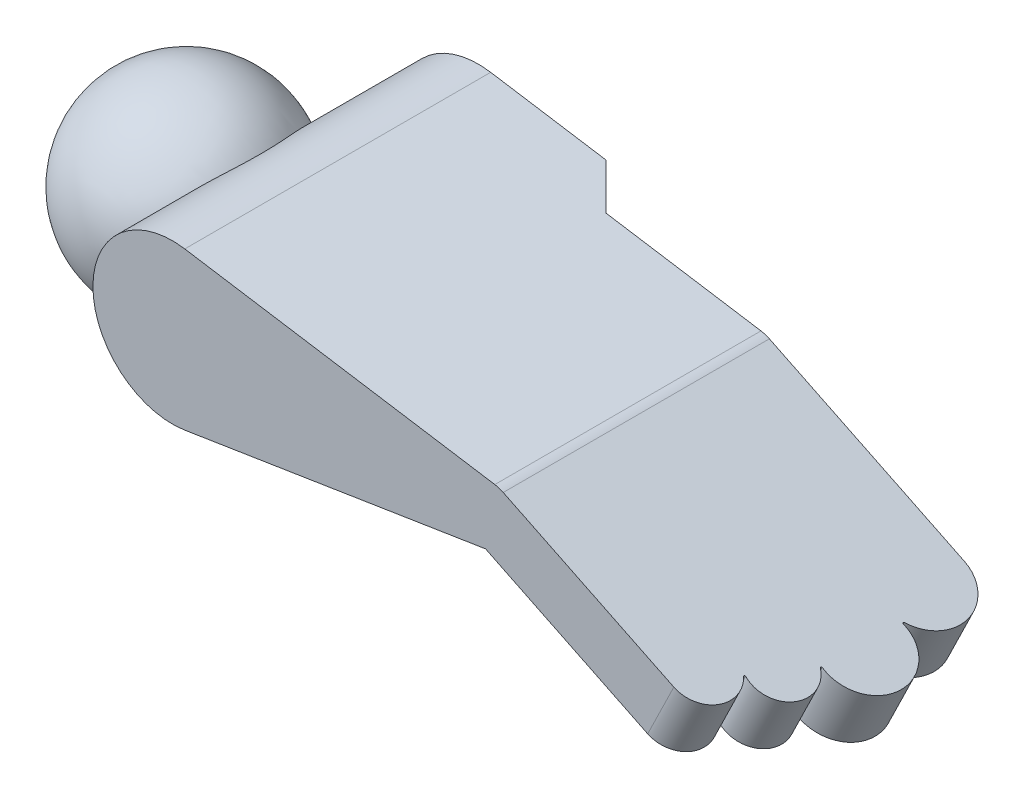
ISO-10303-21;
HEADER;
FILE_DESCRIPTION(('STEP AP214'),'2;1');
FILE_NAME('part.step','',(''),(''),'','','');
FILE_SCHEMA(('AUTOMOTIVE_DESIGN { 1 0 10303 214 1 1 1 1 }'));
ENDSEC;
DATA;
#1=APPLICATION_CONTEXT('core data for automotive mechanical design processes');
#2=APPLICATION_PROTOCOL_DEFINITION('international standard','automotive_design',2000,#1);
#3=PRODUCT_CONTEXT('',#1,'mechanical');
#4=PRODUCT('Part','Part','',(#3));
#5=PRODUCT_RELATED_PRODUCT_CATEGORY('part','',(#4));
#6=PRODUCT_DEFINITION_FORMATION('','',#4);
#7=PRODUCT_DEFINITION_CONTEXT('part definition',#1,'design');
#8=PRODUCT_DEFINITION('design','',#6,#7);
#9=PRODUCT_DEFINITION_SHAPE('','',#8);
#10=(LENGTH_UNIT() NAMED_UNIT(*) SI_UNIT(.MILLI.,.METRE.));
#11=(NAMED_UNIT(*) PLANE_ANGLE_UNIT() SI_UNIT($,.RADIAN.));
#12=(NAMED_UNIT(*) SI_UNIT($,.STERADIAN.) SOLID_ANGLE_UNIT());
#13=UNCERTAINTY_MEASURE_WITH_UNIT(LENGTH_MEASURE(1.E-05),#10,'distance_accuracy_value','');
#14=(GEOMETRIC_REPRESENTATION_CONTEXT(3) GLOBAL_UNCERTAINTY_ASSIGNED_CONTEXT((#13)) GLOBAL_UNIT_ASSIGNED_CONTEXT((#10,
#11,#12)) REPRESENTATION_CONTEXT('',''));
#15=CARTESIAN_POINT('',(0.,0.,0.));
#16=DIRECTION('',(0.,0.,1.));
#17=DIRECTION('',(1.,0.,0.));
#18=AXIS2_PLACEMENT_3D('',#15,#16,#17);
#19=CARTESIAN_POINT('',(-1.11022302462516E-13,0.,42.545));
#20=DIRECTION('',(0.,0.,-1.));
#21=DIRECTION('',(-1.,0.,0.));
#22=AXIS2_PLACEMENT_3D('',#19,#20,#21);
#23=CYLINDRICAL_SURFACE('',#22,25.4);
#24=CARTESIAN_POINT('',(-14.2875000000001,21.0006510315752,0.));
#25=CARTESIAN_POINT('',(-14.2874986942665,21.0006504840851,0.445221900465597));
#26=CARTESIAN_POINT('',(-14.2953081922359,20.9953449296755,0.890426361089322));
#27=CARTESIAN_POINT('',(-14.3264868198177,20.9740826371853,1.78007168919305));
#28=CARTESIAN_POINT('',(-14.3498569674293,20.9581252022439,2.22451250480701));
#29=CARTESIAN_POINT('',(-14.4120006937447,20.9154409688301,3.11188211675979));
#30=CARTESIAN_POINT('',(-14.4507770141651,20.8887122534647,3.5548106298074));
#31=CARTESIAN_POINT('',(-14.5434469305168,20.8242950444131,4.43829447397916));
#32=CARTESIAN_POINT('',(-14.5973419405579,20.7866055255082,4.87884957917874));
#33=CARTESIAN_POINT('',(-14.7813505313174,20.6565920938604,6.19704823314705));
#34=CARTESIAN_POINT('',(-14.933707064299,20.5473762862208,7.07009349322586));
#35=CARTESIAN_POINT('',(-15.2933299297853,20.2811215383024,8.79718220074844));
#36=CARTESIAN_POINT('',(-15.5005922793714,20.1240860667829,9.65122702163243));
#37=CARTESIAN_POINT('',(-15.9644327536828,19.7581430548751,11.3354310139956));
#38=CARTESIAN_POINT('',(-16.2210585055284,19.5491853612722,12.1655662202228));
#39=CARTESIAN_POINT('',(-16.7762879292823,19.0748373220827,13.7952811622892));
#40=CARTESIAN_POINT('',(-17.074896817441,18.8094399619717,14.5948570855255));
#41=CARTESIAN_POINT('',(-17.7050993456687,18.2174673783565,16.1564260717051));
#42=CARTESIAN_POINT('',(-18.0366554205533,17.8909614615965,16.9184604878274));
#43=CARTESIAN_POINT('',(-18.72301395747,17.1713645796119,18.3992916126226));
#44=CARTESIAN_POINT('',(-19.077807491936,16.7782990948599,19.1181047252024));
#45=CARTESIAN_POINT('',(-19.6980741774511,16.0408372382135,20.3109683821504));
#46=CARTESIAN_POINT('',(-19.9607294175346,15.7136483536111,20.7971804645095));
#47=CARTESIAN_POINT('',(-20.4873489903725,15.020582613139,21.740533970935));
#48=CARTESIAN_POINT('',(-20.751313205354,14.65470917974,22.197677960971));
#49=CARTESIAN_POINT('',(-21.274961865544,13.8835494219702,23.0789641510367));
#50=CARTESIAN_POINT('',(-21.5346511969972,13.4783123676139,23.5031464403229));
#51=CARTESIAN_POINT('',(-22.0443412853832,12.627461213939,24.3153484578363));
#52=CARTESIAN_POINT('',(-22.2943438885055,12.1818548631691,24.7033750969559));
#53=CARTESIAN_POINT('',(-22.7308063467688,11.3423138017661,25.3666569582657));
#54=CARTESIAN_POINT('',(-22.9200834161576,10.9554874876247,25.6490711097611));
#55=CARTESIAN_POINT('',(-23.2850711723189,10.1566817400668,26.1856234423785));
#56=CARTESIAN_POINT('',(-23.4607847356159,9.74470767331466,26.4397676240166));
#57=CARTESIAN_POINT('',(-23.7952610731409,8.89680874924633,26.9174378992023));
#58=CARTESIAN_POINT('',(-23.9540252529345,8.46088588248605,27.1409665320487));
#59=CARTESIAN_POINT('',(-24.2512534757126,7.56693688587108,27.5550523199941));
#60=CARTESIAN_POINT('',(-24.389717192859,7.10891040139304,27.7456089458758));
#61=CARTESIAN_POINT('',(-24.6441297571778,6.16971403368266,28.0928032591503));
#62=CARTESIAN_POINT('',(-24.7598936666472,5.6883909170392,28.2491634433944));
#63=CARTESIAN_POINT('',(-24.9646033773291,4.70941624230395,28.5239230460117));
#64=CARTESIAN_POINT('',(-25.0535487892989,4.21176444733458,28.6423219134173));
#65=CARTESIAN_POINT('',(-25.2021646538441,3.20465425990388,28.8393336708689));
#66=CARTESIAN_POINT('',(-25.2618533468752,2.6952034317352,28.9179713514764));
#67=CARTESIAN_POINT('',(-25.3503347241816,1.66901685292011,29.0343147307974));
#68=CARTESIAN_POINT('',(-25.3791317155348,1.15228212801263,29.0720261356688));
#69=CARTESIAN_POINT('',(-25.4033365174728,0.183902258199813,29.1037264095119));
#70=CARTESIAN_POINT('',(-25.4025903098687,-0.267492897680797,29.1027514849805));
#71=CARTESIAN_POINT('',(-25.3771121944252,-1.16840876612937,29.0693781103997));
#72=CARTESIAN_POINT('',(-25.3523827477916,-1.61792966628318,29.0369828847616));
#73=CARTESIAN_POINT('',(-25.279490574644,-2.5116470499489,28.9411810594653));
#74=CARTESIAN_POINT('',(-25.2313313649835,-2.95584432229802,28.877779113969));
#75=CARTESIAN_POINT('',(-25.1126199815715,-3.835809586465,28.7207294192038));
#76=CARTESIAN_POINT('',(-25.042067395072,-4.27157742275694,28.6270811124424));
#77=CARTESIAN_POINT('',(-24.8822465753656,-5.12006857663347,28.4135663160798));
#78=CARTESIAN_POINT('',(-24.7935407591993,-5.5330962716872,28.2944838477271));
#79=CARTESIAN_POINT('',(-24.5979903249191,-6.34615695257182,28.0299277091399));
#80=CARTESIAN_POINT('',(-24.4911463087952,-6.74619036914597,27.8844549147648));
#81=CARTESIAN_POINT('',(-24.2611922024166,-7.53139660098542,27.5684655593425));
#82=CARTESIAN_POINT('',(-24.1380815889216,-7.9165689377058,27.3979481926779));
#83=CARTESIAN_POINT('',(-23.8776053229467,-8.67058905862422,27.0332991326326));
#84=CARTESIAN_POINT('',(-23.7402378123342,-9.03943470597031,26.8391643605748));
#85=CARTESIAN_POINT('',(-23.4382445568038,-9.79756248541905,26.4071611140558));
#86=CARTESIAN_POINT('',(-23.2722715653822,-10.1849101485111,26.1668402326586));
#87=CARTESIAN_POINT('',(-22.9283245879777,-10.9372326187328,25.6611527226464));
#88=CARTESIAN_POINT('',(-22.7503501265942,-11.3022065385025,25.3957851017169));
#89=CARTESIAN_POINT('',(-22.3850891575176,-12.009424049734,24.8417600918975));
#90=CARTESIAN_POINT('',(-22.1977975852448,-12.351655037252,24.5530899820029));
#91=CARTESIAN_POINT('',(-21.8166665848664,-13.013024023214,23.9543768612102));
#92=CARTESIAN_POINT('',(-21.6228259741794,-13.3321578178764,23.6443299796046));
#93=CARTESIAN_POINT('',(-21.1336062810806,-14.1006775780672,22.8451903507569));
#94=CARTESIAN_POINT('',(-20.8357310304868,-14.5357893412475,22.3438210130412));
#95=CARTESIAN_POINT('',(-20.2390038816648,-15.3557839209573,21.3020218669451));
#96=CARTESIAN_POINT('',(-19.9401516449805,-15.7406468866986,20.7615767518924));
#97=CARTESIAN_POINT('',(-19.3483285713351,-16.4626964595998,19.6455313531435));
#98=CARTESIAN_POINT('',(-19.0553662922109,-16.7998174686625,19.069884225942));
#99=CARTESIAN_POINT('',(-18.4822534895632,-17.4283449288991,17.888244173111));
#100=CARTESIAN_POINT('',(-18.2021018325467,-17.7197554301379,17.2822539422397));
#101=CARTESIAN_POINT('',(-17.6555385601781,-18.2645421536684,16.0325252976359));
#102=CARTESIAN_POINT('',(-17.3894597033053,-18.5171502143908,15.388307362588));
#103=CARTESIAN_POINT('',(-16.8819412450539,-18.9809974338255,14.0757640556329));
#104=CARTESIAN_POINT('',(-16.6405018685819,-19.1922362149396,13.407438463749));
#105=CARTESIAN_POINT('',(-16.187086473272,-19.5761715888971,12.0502610269937));
#106=CARTESIAN_POINT('',(-15.9751029506536,-19.748878004547,11.3614144642725));
#107=CARTESIAN_POINT('',(-15.5846354049784,-20.0584443736292,9.9663637939211));
#108=CARTESIAN_POINT('',(-15.4061540631933,-20.1953014582875,9.26015830211918));
#109=CARTESIAN_POINT('',(-15.057140977541,-20.457239134323,7.70429763836023));
#110=CARTESIAN_POINT('',(-14.893927079856,-20.575677783891,6.85186323566165));
#111=CARTESIAN_POINT('',(-14.623601226045,-20.7686751885555,5.13318218970042));
#112=CARTESIAN_POINT('',(-14.516494915344,-20.8432295282001,4.26693416557322));
#113=CARTESIAN_POINT('',(-14.3613252214602,-20.9504482731531,2.52642942223252));
#114=CARTESIAN_POINT('',(-14.3132716710879,-20.9831057022924,1.65217139369096));
#115=CARTESIAN_POINT('',(-14.2775752024917,-21.0074107874628,-0.0981238573051221));
#116=CARTESIAN_POINT('',(-14.2899310179491,-20.9990593031344,-0.974161042079673));
#117=CARTESIAN_POINT('',(-14.3753479695873,-20.9406805821823,-2.73510967254932));
#118=CARTESIAN_POINT('',(-14.4493194834229,-20.8900283183938,-3.61995637844773));
#119=CARTESIAN_POINT('',(-14.6570509388758,-20.7448032633027,-5.37897980113163));
#120=CARTESIAN_POINT('',(-14.7908128513621,-20.6502290241973,-6.25315616521507));
#121=CARTESIAN_POINT('',(-15.1144931659491,-20.4145085488666,-7.98547571101311));
#122=CARTESIAN_POINT('',(-15.3044607078546,-20.2733215471805,-8.84360416133193));
#123=CARTESIAN_POINT('',(-15.7351836903612,-19.9408609717466,-10.5371029047903));
#124=CARTESIAN_POINT('',(-15.9759382526865,-19.749588264133,-11.372473591205));
#125=CARTESIAN_POINT('',(-16.502983252549,-19.3113853670171,-13.0192803252172));
#126=CARTESIAN_POINT('',(-16.7895217254826,-19.0641487636749,-13.8305556871584));
#127=CARTESIAN_POINT('',(-17.3989974589035,-18.5095808350739,-15.4183814530545));
#128=CARTESIAN_POINT('',(-17.7219398091186,-18.2022411022038,-16.1949269800825));
#129=CARTESIAN_POINT('',(-18.3940944779414,-17.5227091131552,-17.7057164687854));
#130=CARTESIAN_POINT('',(-18.7432676229845,-17.1506125133527,-18.4400207281911));
#131=CARTESIAN_POINT('',(-19.457196742374,-16.3361687985509,-19.8603809612778));
#132=CARTESIAN_POINT('',(-19.8219449912997,-15.8938562222404,-20.546460418213));
#133=CARTESIAN_POINT('',(-20.436376464989,-15.0891288542457,-21.650491023163));
#134=CARTESIAN_POINT('',(-20.6852896043994,-14.7468519300986,-22.0836404499622));
#135=CARTESIAN_POINT('',(-21.1800880698568,-14.0269234948975,-22.9213987966382));
#136=CARTESIAN_POINT('',(-21.4259737436976,-13.6492760909071,-23.326011020588));
#137=CARTESIAN_POINT('',(-21.9096759813927,-12.8584862291663,-24.1031257854199));
#138=CARTESIAN_POINT('',(-22.1475016927433,-12.4453860275079,-24.4756655205535));
#139=CARTESIAN_POINT('',(-22.6102745449211,-11.5833772847154,-25.1857389967294));
#140=CARTESIAN_POINT('',(-22.8352237511423,-11.1344745141227,-25.5232783589269));
#141=CARTESIAN_POINT('',(-23.2283719835899,-10.2849914243429,-26.1029280496934));
#142=CARTESIAN_POINT('',(-23.3995385318585,-9.89006479986963,-26.3513230174568));
#143=CARTESIAN_POINT('',(-23.7264812663222,-9.07775684684525,-26.8198667123015));
#144=CARTESIAN_POINT('',(-23.8822605045342,-8.66037999668382,-27.0400210434078));
#145=CARTESIAN_POINT('',(-24.1753982658379,-7.80477817202379,-27.449952314982));
#146=CARTESIAN_POINT('',(-24.3127591392672,-7.36655586726711,-27.6397331319642));
#147=CARTESIAN_POINT('',(-24.5661721357114,-6.47143811366118,-27.9868713512135));
#148=CARTESIAN_POINT('',(-24.6822239483945,-6.01454239298258,-28.1442282812836));
#149=CARTESIAN_POINT('',(-24.891045116151,-5.08189863963258,-28.4255181092953));
#150=CARTESIAN_POINT('',(-24.9836555781958,-4.6060459944122,-28.5492233058053));
#151=CARTESIAN_POINT('',(-25.1422934569433,-3.64193759713006,-28.760153178234));
#152=CARTESIAN_POINT('',(-25.208320586449,-3.15368171112862,-28.8473774600261));
#153=CARTESIAN_POINT('',(-25.3120469887455,-2.16914273854083,-28.9840501416499));
#154=CARTESIAN_POINT('',(-25.3497587696533,-1.67286329539576,-29.0335152215191));
#155=CARTESIAN_POINT('',(-25.3958801163721,-0.676633260395486,-29.0939771236016));
#156=CARTESIAN_POINT('',(-25.4042927659409,-0.176683060441385,-29.1049779942053));
#157=CARTESIAN_POINT('',(-25.3923157033826,0.766304832102019,-29.0892927409928));
#158=CARTESIAN_POINT('',(-25.3750400497521,1.20945816685978,-29.0666813510512));
#159=CARTESIAN_POINT('',(-25.3175888579372,2.09165898268628,-28.9912780131989));
#160=CARTESIAN_POINT('',(-25.2774153583744,2.53070682573524,-28.9384887520578));
#161=CARTESIAN_POINT('',(-25.175019659029,3.40156093716508,-28.8033599943676));
#162=CARTESIAN_POINT('',(-25.1127994210798,3.83336784630239,-28.7210231271098));
#163=CARTESIAN_POINT('',(-24.9675772230404,4.68695346128786,-28.527727082686));
#164=CARTESIAN_POINT('',(-24.884574626392,5.10873185953195,-28.4167670287958));
#165=CARTESIAN_POINT('',(-24.6995938082608,5.93890324025257,-28.1676590049885));
#166=CARTESIAN_POINT('',(-24.5976546363742,6.34732177001901,-28.0295669514588));
#167=CARTESIAN_POINT('',(-24.3765577215041,7.14958616940364,-27.7274053779981));
#168=CARTESIAN_POINT('',(-24.2574002237255,7.54343224644696,-27.5633362280021));
#169=CARTESIAN_POINT('',(-24.0038934966984,8.31492606818444,-27.2106645660801));
#170=CARTESIAN_POINT('',(-23.8695429343697,8.69257238745235,-27.0220599011237));
#171=CARTESIAN_POINT('',(-23.5877809959133,9.4304076486978,-26.6218229466976));
#172=CARTESIAN_POINT('',(-23.4403678470098,9.79059421084868,-26.410187530741));
#173=CARTESIAN_POINT('',(-23.1157715918168,10.5359429477581,-25.9379394700155));
#174=CARTESIAN_POINT('',(-22.9371602672121,10.9186960590394,-25.6745060484112));
#175=CARTESIAN_POINT('',(-22.5692452788229,11.6602112282317,-25.1226021883565));
#176=CARTESIAN_POINT('',(-22.3799410682892,12.0189720573157,-24.8341304692409));
#177=CARTESIAN_POINT('',(-21.9934803227064,12.7123739254043,-24.2339795416666));
#178=CARTESIAN_POINT('',(-21.796319585391,13.0470017799465,-23.9222878337507));
#179=CARTESIAN_POINT('',(-21.3970326149972,13.6920020480466,-23.27767906627));
#180=CARTESIAN_POINT('',(-21.1949054876361,14.0023700505086,-22.944758166555));
#181=CARTESIAN_POINT('',(-20.6843714396607,14.751764240628,-22.0841471339592));
#182=CARTESIAN_POINT('',(-20.3744622422452,15.1754402942078,-21.5439018143078));
#183=CARTESIAN_POINT('',(-19.7577641712185,15.9700955542904,-20.4241968504163));
#184=CARTESIAN_POINT('',(-19.4509766028517,16.3410534957322,-19.8447215202125));
#185=CARTESIAN_POINT('',(-18.8476413750872,17.0334256985636,-18.6504649392776));
#186=CARTESIAN_POINT('',(-18.551110662881,17.3547607446053,-18.0356293450129));
#187=CARTESIAN_POINT('',(-17.9755771371757,17.9502116863526,-16.7758230917445));
#188=CARTESIAN_POINT('',(-17.6965724887382,18.2243325305282,-16.1308555998512));
#189=CARTESIAN_POINT('',(-17.1574124395316,18.7329370633162,-14.8032264266137));
#190=CARTESIAN_POINT('',(-16.8976653476613,18.9666552048907,-14.1201063637877));
#191=CARTESIAN_POINT('',(-16.4079806079214,19.3918373031754,-12.730413996964));
#192=CARTESIAN_POINT('',(-16.1780448431024,19.5832985912416,-12.0238402150351));
#193=CARTESIAN_POINT('',(-15.7530639248419,19.9267544702823,-10.5918838926758));
#194=CARTESIAN_POINT('',(-15.5579771222208,20.0787962723092,-9.86652500684206));
#195=CARTESIAN_POINT('',(-15.2064216883631,20.3463415235515,-8.39995738188528));
#196=CARTESIAN_POINT('',(-15.0499477829225,20.4618499635315,-7.65875082246988));
#197=CARTESIAN_POINT('',(-14.8116059079042,20.6347355531499,-6.34493500809818));
#198=CARTESIAN_POINT('',(-14.7208466792511,20.6994150797693,-5.77486956138397));
#199=CARTESIAN_POINT('',(-14.5644656215408,20.809746359997,-4.62953309722101));
#200=CARTESIAN_POINT('',(-14.4988402141455,20.8554008223124,-4.05426283273617));
#201=CARTESIAN_POINT('',(-14.3935012062785,20.9282396035887,-2.90007628078942));
#202=CARTESIAN_POINT('',(-14.3537931079563,20.955420000624,-2.32115924545218));
#203=CARTESIAN_POINT('',(-14.3007922663058,20.9916268208374,-1.1614850149657));
#204=CARTESIAN_POINT('',(-14.2875017031411,21.000651745697,-0.580727671902138));
#205=CARTESIAN_POINT('',(-14.2875000000001,21.0006510315752,0.));
#206=B_SPLINE_CURVE_WITH_KNOTS('',3,(#24,#25,#26,#27,#28,#29,#30,#31,#32,#33,#34,#35,#36,#37,
#38,#39,#40,#41,#42,#43,#44,#45,#46,#47,#48,#49,#50,#51,#52,#53,#54,#55,#56,#57,#58,#59,#60,#61,
#62,#63,#64,#65,#66,#67,#68,#69,#70,#71,#72,#73,#74,#75,#76,#77,#78,#79,#80,#81,#82,#83,#84,#85,
#86,#87,#88,#89,#90,#91,#92,#93,#94,#95,#96,#97,#98,#99,#100,#101,#102,#103,#104,#105,#106,#107,
#108,#109,#110,#111,#112,#113,#114,#115,#116,#117,#118,#119,#120,#121,#122,#123,#124,#125,#126,
#127,#128,#129,#130,#131,#132,#133,#134,#135,#136,#137,#138,#139,#140,#141,#142,#143,#144,#145,
#146,#147,#148,#149,#150,#151,#152,#153,#154,#155,#156,#157,#158,#159,#160,#161,#162,#163,#164,
#165,#166,#167,#168,#169,#170,#171,#172,#173,#174,#175,#176,#177,#178,#179,#180,#181,#182,#183,
#184,#185,#186,#187,#188,#189,#190,#191,#192,#193,#194,#195,#196,#197,#198,#199,#200,#201,#202,
#203,#204,#205),.UNSPECIFIED.,.T.,.F.,(4,2,2,2,2,2,2,2,2,2,2,2,2,2,2,2,2,2,2,2,2,2,2,2,2,2,2,2,
2,2,2,2,2,2,2,2,2,2,2,2,2,2,2,2,2,2,2,2,2,2,2,2,2,2,2,2,2,2,2,2,2,2,2,2,2,2,2,2,2,2,2,2,2,2,2,2,
2,2,2,2,2,2,2,2,2,2,2,2,2,2,4),(0.,1.33553453870049,2.67115645849026,4.00701617506112,
5.34300088146883,8.01836659782021,10.6935382937792,13.3713041313765,16.0494029660292,
18.7244826207466,21.3985405015369,23.3235736274041,25.248436585455,27.1709205686333,
29.0930363257601,30.6365856970336,32.1798068105105,33.7228998493409,35.2660176532956,
36.8212278977692,38.3764607134181,39.9307226630667,41.4847678814431,42.8372635889265,
44.1896205154007,45.5417745130463,46.8939534346378,48.209283924538,49.5245707683715,
50.8398999307591,52.1554007386584,53.6093464692773,55.0633498272503,56.5181523753357,
57.9732190409083,60.1528571378663,62.3333537121839,64.5168178386656,66.7000883953737,
68.9221679816625,71.1442678490391,73.3658006019902,75.5875110745736,78.2123219991518,
80.837396975877,83.4629089917733,86.088365971166,88.7533169834432,91.4183558468972,
94.085731636974,96.753061303067,99.4353644146858,102.118043012817,104.796791984184,
107.474227359658,109.28947345652,111.104509035735,112.917410550587,114.730020456094,
116.219465223252,117.708613968729,119.19757250513,120.686552724063,122.185370628423,
123.68420472505,125.182376331515,126.680390249409,128.010975946393,129.341443198293,
130.671792088014,132.002181730965,133.329857799361,134.657514962266,135.98528870788,
137.313242927768,138.805197338486,140.297228105088,141.790067926469,143.283178558039,
145.539671353279,147.797071788768,150.058039374249,152.318769845749,154.61850887813,
156.918393104233,159.215509997661,161.512312949924,163.254059611024,164.995558204898,
166.73742639238,168.479438325291),.UNSPECIFIED.);
#207=CARTESIAN_POINT('',(-14.2875000000001,21.0006510315752,0.));
#208=VERTEX_POINT('',#207);
#209=EDGE_CURVE('E20',#208,#208,#206,.T.);
#210=ORIENTED_EDGE('',*,*,#209,.T.);
#211=EDGE_LOOP('',(#210));
#212=FACE_BOUND('',#211,.T.);
#213=CARTESIAN_POINT('',(-1.11022302462516E-13,0.,-29.845));
#214=DIRECTION('',(0.,0.,-1.));
#215=DIRECTION('',(-1.,0.,0.));
#216=AXIS2_PLACEMENT_3D('',#213,#214,#215);
#217=CIRCLE('',#216,25.4);
#218=CARTESIAN_POINT('',(3.96874999999997,-25.0880254989805,-29.845));
#219=VERTEX_POINT('',#218);
#220=CARTESIAN_POINT('',(-21.9970452561249,-12.6999999999998,-29.845));
#221=VERTEX_POINT('',#220);
#222=EDGE_CURVE('E311',#219,#221,#217,.T.);
#223=ORIENTED_EDGE('',*,*,#222,.F.);
#224=DIRECTION('',(0.,0.,-1.));
#225=VECTOR('',#224,1.);
#226=CARTESIAN_POINT('',(3.96874999999985,-25.0880254989806,42.545));
#227=LINE('',#226,#225);
#228=CARTESIAN_POINT('',(3.96874999999985,-25.0880254989806,42.545));
#229=VERTEX_POINT('',#228);
#230=EDGE_CURVE('E283',#229,#219,#227,.T.);
#231=ORIENTED_EDGE('',*,*,#230,.F.);
#232=CARTESIAN_POINT('',(-1.11022302462516E-13,0.,42.545));
#233=DIRECTION('',(0.,0.,1.));
#234=DIRECTION('',(1.,0.,0.));
#235=AXIS2_PLACEMENT_3D('',#232,#233,#234);
#236=CIRCLE('',#235,25.4);
#237=CARTESIAN_POINT('',(3.96874999999997,25.0880254989806,42.545));
#238=VERTEX_POINT('',#237);
#239=EDGE_CURVE('E281',#238,#229,#236,.T.);
#240=ORIENTED_EDGE('',*,*,#239,.F.);
#241=DIRECTION('',(0.,0.,-1.));
#242=VECTOR('',#241,1.);
#243=CARTESIAN_POINT('',(3.96874999999997,25.0880254989806,42.545));
#244=LINE('',#243,#242);
#245=CARTESIAN_POINT('',(3.96874999999997,25.0880254989806,-55.245));
#246=VERTEX_POINT('',#245);
#247=EDGE_CURVE('E175',#238,#246,#244,.T.);
#248=ORIENTED_EDGE('',*,*,#247,.T.);
#249=CARTESIAN_POINT('',(-1.11022302462516E-13,0.,-55.245));
#250=DIRECTION('',(0.,0.,-1.));
#251=DIRECTION('',(-1.,0.,0.));
#252=AXIS2_PLACEMENT_3D('',#249,#250,#251);
#253=CIRCLE('',#252,25.4);
#254=CARTESIAN_POINT('',(-21.9970452561249,-12.6999999999998,-55.245));
#255=VERTEX_POINT('',#254);
#256=EDGE_CURVE('E172',#255,#246,#253,.T.);
#257=ORIENTED_EDGE('',*,*,#256,.F.);
#258=DIRECTION('',(0.,0.,-1.));
#259=VECTOR('',#258,1.);
#260=CARTESIAN_POINT('',(-21.9970452561249,-12.6999999999998,-29.845));
#261=LINE('',#260,#259);
#262=EDGE_CURVE('E159',#221,#255,#261,.T.);
#263=ORIENTED_EDGE('',*,*,#262,.F.);
#264=EDGE_LOOP('',(#223,#231,#240,#248,#257,#263));
#265=FACE_BOUND('',#264,.T.);
#266=ADVANCED_FACE('F16',(#212,#265),#23,.T.);
#267=CARTESIAN_POINT('',(176.861881251004,-47.3235725570233,42.5450000000001));
#268=DIRECTION('',(0.43853899941014,0.898712159702067,0.));
#269=DIRECTION('',(-0.898712159702067,0.43853899941014,0.));
#270=AXIS2_PLACEMENT_3D('',#267,#268,#269);
#271=PLANE('',#270);
#272=CARTESIAN_POINT('',(159.741414608679,-38.9694046182602,-29.845));
#273=DIRECTION('',(0.43853899941014,0.898712159702067,0.));
#274=DIRECTION('',(-0.898712159702067,0.43853899941014,0.));
#275=AXIS2_PLACEMENT_3D('',#272,#273,#274);
#276=CIRCLE('',#275,12.7);
#277=CARTESIAN_POINT('',(164.716588696425,-41.3971094654436,-18.4150440958163));
#278=VERTEX_POINT('',#277);
#279=CARTESIAN_POINT('',(159.741414608679,-38.9694046182602,-42.5449999999999));
#280=VERTEX_POINT('',#279);
#281=EDGE_CURVE('E243',#278,#280,#276,.T.);
#282=ORIENTED_EDGE('',*,*,#281,.F.);
#283=CARTESIAN_POINT('',(164.81609217818,-41.4456635623873,-18.1864449777326));
#284=DIRECTION('',(0.43853899941014,0.898712159702067,0.));
#285=DIRECTION('',(-0.898712159702067,0.43853899941014,0.));
#286=AXIS2_PLACEMENT_3D('',#283,#284,#285);
#287=CIRCLE('',#286,0.254000000000002);
#288=CARTESIAN_POINT('',(164.828487171211,-41.451711870272,-17.9328196987885));
#289=VERTEX_POINT('',#288);
#290=EDGE_CURVE('E265',#289,#278,#287,.F.);
#291=ORIENTED_EDGE('',*,*,#290,.F.);
#292=CARTESIAN_POINT('',(165.448236822787,-41.7541272645145,-5.25155575158287));
#293=DIRECTION('',(0.43853899941014,0.898712159702067,0.));
#294=DIRECTION('',(-0.898712159702067,0.43853899941014,0.));
#295=AXIS2_PLACEMENT_3D('',#292,#293,#294);
#296=CIRCLE('',#295,12.7);
#297=CARTESIAN_POINT('',(164.238904245477,-41.1640167461661,7.37695501943009));
#298=VERTEX_POINT('',#297);
#299=EDGE_CURVE('E263',#298,#289,#296,.T.);
#300=ORIENTED_EDGE('',*,*,#299,.F.);
#301=CARTESIAN_POINT('',(164.21471759393,-41.1522145357992,7.62952523485033));
#302=DIRECTION('',(0.43853899941014,0.898712159702067,0.));
#303=DIRECTION('',(-0.898712159702067,0.43853899941014,0.));
#304=AXIS2_PLACEMENT_3D('',#301,#302,#303);
#305=CIRCLE('',#304,0.253999999999994);
#306=CARTESIAN_POINT('',(164.098527906002,-41.0955181743046,7.84816072833744));
#307=VERTEX_POINT('',#306);
#308=EDGE_CURVE('E261',#307,#298,#305,.F.);
#309=ORIENTED_EDGE('',*,*,#308,.F.);
#310=CARTESIAN_POINT('',(159.741414608679,-38.9694046182602,16.0469917341026));
#311=DIRECTION('',(0.43853899941014,0.898712159702067,0.));
#312=DIRECTION('',(-0.898712159702067,0.43853899941014,0.));
#313=AXIS2_PLACEMENT_3D('',#310,#311,#312);
#314=CIRCLE('',#313,9.525);
#315=CARTESIAN_POINT('',(157.682532504989,-37.9647446858131,25.2923845274479));
#316=VERTEX_POINT('',#315);
#317=EDGE_CURVE('E259',#316,#307,#314,.T.);
#318=ORIENTED_EDGE('',*,*,#317,.F.);
#319=CARTESIAN_POINT('',(157.627628982224,-37.9379537542812,25.5389283352705));
#320=DIRECTION('',(0.43853899941014,0.898712159702067,0.));
#321=DIRECTION('',(-0.898712159702067,0.43853899941014,0.));
#322=AXIS2_PLACEMENT_3D('',#319,#320,#321);
#323=CIRCLE('',#322,0.254000000000007);
#324=CARTESIAN_POINT('',(157.480618119654,-37.8662177753273,25.7332418850037));
#325=VERTEX_POINT('',#324);
#326=EDGE_CURVE('E257',#325,#316,#323,.F.);
#327=ORIENTED_EDGE('',*,*,#326,.F.);
#328=CARTESIAN_POINT('',(151.967710773275,-35.1761185645596,33.0200000000001));
#329=DIRECTION('',(0.43853899941014,0.898712159702067,0.));
#330=DIRECTION('',(-0.898712159702067,0.43853899941014,0.));
#331=AXIS2_PLACEMENT_3D('',#328,#329,#330);
#332=CIRCLE('',#331,9.525);
#333=CARTESIAN_POINT('',(151.967710773275,-35.1761185645596,42.545));
#334=VERTEX_POINT('',#333);
#335=EDGE_CURVE('E255',#334,#325,#332,.T.);
#336=ORIENTED_EDGE('',*,*,#335,.F.);
#337=DIRECTION('',(0.898712159702067,-0.43853899941014,0.));
#338=VECTOR('',#337,1.);
#339=CARTESIAN_POINT('',(176.861881251004,-47.3235725570233,42.5450000000001));
#340=LINE('',#339,#338);
#341=CARTESIAN_POINT('',(100.121947229302,-9.87726283775399,42.545));
#342=VERTEX_POINT('',#341);
#343=EDGE_CURVE('E271',#342,#334,#340,.T.);
#344=ORIENTED_EDGE('',*,*,#343,.F.);
#345=DIRECTION('',(0.,0.,-1.));
#346=VECTOR('',#345,1.);
#347=CARTESIAN_POINT('',(100.121947229302,-9.87726283775399,42.545));
#348=LINE('',#347,#346);
#349=CARTESIAN_POINT('',(100.121947229302,-9.87726283775399,-42.545));
#350=VERTEX_POINT('',#349);
#351=EDGE_CURVE('E303',#342,#350,#348,.T.);
#352=ORIENTED_EDGE('',*,*,#351,.T.);
#353=DIRECTION('',(0.898712159702067,-0.43853899941014,0.));
#354=VECTOR('',#353,1.);
#355=CARTESIAN_POINT('',(176.861881251003,-47.3235725570233,-42.5449999999999));
#356=LINE('',#355,#354);
#357=EDGE_CURVE('E285',#350,#280,#356,.T.);
#358=ORIENTED_EDGE('',*,*,#357,.T.);
#359=EDGE_LOOP('',(#282,#291,#300,#309,#318,#327,#336,#344,#352,#358));
#360=FACE_BOUND('',#359,.T.);
#361=ADVANCED_FACE('F341',(#360),#271,.F.);
#362=CARTESIAN_POINT('',(105.777083969382,8.56023332116211,42.545));
#363=DIRECTION('',(-0.43853899941014,-0.898712159702067,0.));
#364=DIRECTION('',(0.898712159702067,-0.43853899941014,0.));
#365=AXIS2_PLACEMENT_3D('',#362,#363,#364);
#366=PLANE('',#365);
#367=CARTESIAN_POINT('',(168.095582547442,-21.8489379759357,-29.845));
#368=DIRECTION('',(0.43853899941014,0.898712159702067,0.));
#369=DIRECTION('',(-0.898712159702067,0.43853899941014,0.));
#370=AXIS2_PLACEMENT_3D('',#367,#368,#369);
#371=CIRCLE('',#370,12.7);
#372=CARTESIAN_POINT('',(173.070756635188,-24.2766428231191,-18.4150440958163));
#373=VERTEX_POINT('',#372);
#374=CARTESIAN_POINT('',(168.095582547442,-21.8489379759357,-42.5449999999999));
#375=VERTEX_POINT('',#374);
#376=EDGE_CURVE('E237',#373,#375,#371,.T.);
#377=ORIENTED_EDGE('',*,*,#376,.T.);
#378=DIRECTION('',(-0.898712159702067,0.43853899941014,0.));
#379=VECTOR('',#378,1.);
#380=CARTESIAN_POINT('',(105.777083969382,8.56023332116217,-42.545));
#381=LINE('',#380,#379);
#382=CARTESIAN_POINT('',(105.777083969382,8.56023332116217,-42.545));
#383=VERTEX_POINT('',#382);
#384=EDGE_CURVE('E288',#375,#383,#381,.T.);
#385=ORIENTED_EDGE('',*,*,#384,.T.);
#386=DIRECTION('',(0.,0.,-1.));
#387=VECTOR('',#386,1.);
#388=CARTESIAN_POINT('',(105.777083969382,8.56023332116211,42.545));
#389=LINE('',#388,#387);
#390=CARTESIAN_POINT('',(105.777083969382,8.56023332116211,42.545));
#391=VERTEX_POINT('',#390);
#392=EDGE_CURVE('E300',#391,#383,#389,.T.);
#393=ORIENTED_EDGE('',*,*,#392,.F.);
#394=DIRECTION('',(-0.898712159702067,0.43853899941014,0.));
#395=VECTOR('',#394,1.);
#396=CARTESIAN_POINT('',(105.777083969382,8.56023332116211,42.545));
#397=LINE('',#396,#395);
#398=CARTESIAN_POINT('',(160.321878712038,-18.0556519222352,42.5450000000001));
#399=VERTEX_POINT('',#398);
#400=EDGE_CURVE('E275',#399,#391,#397,.T.);
#401=ORIENTED_EDGE('',*,*,#400,.F.);
#402=CARTESIAN_POINT('',(160.321878712038,-18.0556519222352,33.0200000000001));
#403=DIRECTION('',(0.43853899941014,0.898712159702067,0.));
#404=DIRECTION('',(-0.898712159702067,0.43853899941014,0.));
#405=AXIS2_PLACEMENT_3D('',#402,#403,#404);
#406=CIRCLE('',#405,9.525);
#407=CARTESIAN_POINT('',(165.834786058417,-20.7457511330029,25.7332418850037));
#408=VERTEX_POINT('',#407);
#409=EDGE_CURVE('E220',#399,#408,#406,.T.);
#410=ORIENTED_EDGE('',*,*,#409,.T.);
#411=CARTESIAN_POINT('',(165.981796920987,-20.8174871119567,25.5389283352705));
#412=DIRECTION('',(-0.43853899941014,-0.898712159702067,0.));
#413=DIRECTION('',(-0.898712159702067,0.43853899941014,0.));
#414=AXIS2_PLACEMENT_3D('',#411,#412,#413);
#415=CIRCLE('',#414,0.254000000000007);
#416=CARTESIAN_POINT('',(166.036700443752,-20.8442780434887,25.2923845274479));
#417=VERTEX_POINT('',#416);
#418=EDGE_CURVE('E223',#408,#417,#415,.T.);
#419=ORIENTED_EDGE('',*,*,#418,.T.);
#420=CARTESIAN_POINT('',(168.095582547442,-21.8489379759358,16.0469917341026));
#421=DIRECTION('',(0.43853899941014,0.898712159702067,0.));
#422=DIRECTION('',(-0.898712159702067,0.43853899941014,0.));
#423=AXIS2_PLACEMENT_3D('',#420,#421,#422);
#424=CIRCLE('',#423,9.525);
#425=CARTESIAN_POINT('',(172.452695844765,-23.9750515319802,7.84816072833744));
#426=VERTEX_POINT('',#425);
#427=EDGE_CURVE('E226',#417,#426,#424,.T.);
#428=ORIENTED_EDGE('',*,*,#427,.T.);
#429=CARTESIAN_POINT('',(172.568885532694,-24.0317478934747,7.62952523485033));
#430=DIRECTION('',(-0.43853899941014,-0.898712159702067,0.));
#431=DIRECTION('',(0.898712159702067,-0.43853899941014,0.));
#432=AXIS2_PLACEMENT_3D('',#429,#430,#431);
#433=CIRCLE('',#432,0.253999999999994);
#434=CARTESIAN_POINT('',(172.59307218424,-24.0435501038417,7.37695501943009));
#435=VERTEX_POINT('',#434);
#436=EDGE_CURVE('E229',#426,#435,#433,.T.);
#437=ORIENTED_EDGE('',*,*,#436,.T.);
#438=CARTESIAN_POINT('',(173.80240476155,-24.6336606221901,-5.25155575158287));
#439=DIRECTION('',(0.43853899941014,0.898712159702067,0.));
#440=DIRECTION('',(-0.898712159702067,0.43853899941014,0.));
#441=AXIS2_PLACEMENT_3D('',#438,#439,#440);
#442=CIRCLE('',#441,12.7);
#443=CARTESIAN_POINT('',(173.182655109975,-24.3312452279477,-17.9328196987885));
#444=VERTEX_POINT('',#443);
#445=EDGE_CURVE('E232',#435,#444,#442,.T.);
#446=ORIENTED_EDGE('',*,*,#445,.T.);
#447=CARTESIAN_POINT('',(173.170260116943,-24.3251969200628,-18.1864449777326));
#448=DIRECTION('',(-0.43853899941014,-0.898712159702067,0.));
#449=DIRECTION('',(0.898712159702067,-0.43853899941014,0.));
#450=AXIS2_PLACEMENT_3D('',#447,#448,#449);
#451=CIRCLE('',#450,0.254000000000002);
#452=EDGE_CURVE('E234',#444,#373,#451,.T.);
#453=ORIENTED_EDGE('',*,*,#452,.T.);
#454=EDGE_LOOP('',(#377,#385,#393,#401,#410,#419,#428,#437,#446,#453));
#455=FACE_BOUND('',#454,.T.);
#456=ADVANCED_FACE('F374',(#455),#366,.F.);
#457=CARTESIAN_POINT('',(-1.11022302462516E-13,0.,42.545));
#458=DIRECTION('',(0.,0.,1.));
#459=DIRECTION('',(1.,0.,0.));
#460=AXIS2_PLACEMENT_3D('',#457,#458,#459);
#461=PLANE('',#460);
#462=ORIENTED_EDGE('',*,*,#343,.T.);
#463=DIRECTION('',(0.43853899941014,0.898712159702067,0.));
#464=VECTOR('',#463,1.);
#465=CARTESIAN_POINT('',(115.766316371968,-109.364807347965,42.545));
#466=LINE('',#465,#464);
#467=EDGE_CURVE('E308',#334,#399,#466,.T.);
#468=ORIENTED_EDGE('',*,*,#467,.T.);
#469=ORIENTED_EDGE('',*,*,#400,.T.);
#470=CARTESIAN_POINT('',(101.6,0.,42.545));
#471=DIRECTION('',(0.,0.,1.));
#472=DIRECTION('',(1.,0.,0.));
#473=AXIS2_PLACEMENT_3D('',#470,#471,#472);
#474=CIRCLE('',#473,9.525);
#475=CARTESIAN_POINT('',(103.08828125,9.40800956211772,42.545));
#476=VERTEX_POINT('',#475);
#477=EDGE_CURVE('E277',#391,#476,#474,.T.);
#478=ORIENTED_EDGE('',*,*,#477,.T.);
#479=DIRECTION('',(-0.987717539329945,0.15625,0.));
#480=VECTOR('',#479,1.);
#481=CARTESIAN_POINT('',(3.96874999999997,25.0880254989806,42.545));
#482=LINE('',#481,#480);
#483=EDGE_CURVE('E279',#476,#238,#482,.T.);
#484=ORIENTED_EDGE('',*,*,#483,.T.);
#485=ORIENTED_EDGE('',*,*,#239,.T.);
#486=DIRECTION('',(0.987717539329944,0.15625,0.));
#487=VECTOR('',#486,1.);
#488=CARTESIAN_POINT('',(100.121947229302,-9.87726283775399,42.545));
#489=LINE('',#488,#487);
#490=EDGE_CURVE('E268',#229,#342,#489,.T.);
#491=ORIENTED_EDGE('',*,*,#490,.T.);
#492=EDGE_LOOP('',(#462,#468,#469,#478,#484,#485,#491));
#493=FACE_BOUND('',#492,.T.);
#494=ADVANCED_FACE('F346',(#493),#461,.T.);
#495=CARTESIAN_POINT('',(-1.11022302462516E-13,0.,-42.545));
#496=DIRECTION('',(0.,0.,1.));
#497=DIRECTION('',(1.,0.,0.));
#498=AXIS2_PLACEMENT_3D('',#495,#496,#497);
#499=PLANE('',#498);
#500=DIRECTION('',(0.987717539329944,0.15625,0.));
#501=VECTOR('',#500,1.);
#502=CARTESIAN_POINT('',(100.121947229302,-9.87726283775399,-42.545));
#503=LINE('',#502,#501);
#504=CARTESIAN_POINT('',(53.5285156249999,-17.2480175305491,-42.545));
#505=VERTEX_POINT('',#504);
#506=EDGE_CURVE('E267',#505,#350,#503,.T.);
#507=ORIENTED_EDGE('',*,*,#506,.F.);
#508=DIRECTION('',(0.,1.,0.));
#509=VECTOR('',#508,1.);
#510=CARTESIAN_POINT('',(53.5285156249999,0.,-42.545));
#511=LINE('',#510,#509);
#512=CARTESIAN_POINT('',(53.5285156249999,17.2480175305492,-42.545));
#513=VERTEX_POINT('',#512);
#514=EDGE_CURVE('E218',#505,#513,#511,.T.);
#515=ORIENTED_EDGE('',*,*,#514,.T.);
#516=DIRECTION('',(-0.987717539329945,0.15625,0.));
#517=VECTOR('',#516,1.);
#518=CARTESIAN_POINT('',(3.96874999999997,25.0880254989806,-42.545));
#519=LINE('',#518,#517);
#520=CARTESIAN_POINT('',(103.08828125,9.40800956211772,-42.545));
#521=VERTEX_POINT('',#520);
#522=EDGE_CURVE('E272',#521,#513,#519,.T.);
#523=ORIENTED_EDGE('',*,*,#522,.F.);
#524=CARTESIAN_POINT('',(101.6,0.,-42.545));
#525=DIRECTION('',(0.,0.,1.));
#526=DIRECTION('',(1.,0.,0.));
#527=AXIS2_PLACEMENT_3D('',#524,#525,#526);
#528=CIRCLE('',#527,9.525);
#529=EDGE_CURVE('E290',#383,#521,#528,.T.);
#530=ORIENTED_EDGE('',*,*,#529,.F.);
#531=ORIENTED_EDGE('',*,*,#384,.F.);
#532=DIRECTION('',(0.43853899941014,0.898712159702067,0.));
#533=VECTOR('',#532,1.);
#534=CARTESIAN_POINT('',(123.540020207372,-113.158093401666,-42.545));
#535=LINE('',#534,#533);
#536=EDGE_CURVE('E306',#280,#375,#535,.T.);
#537=ORIENTED_EDGE('',*,*,#536,.F.);
#538=ORIENTED_EDGE('',*,*,#357,.F.);
#539=EDGE_LOOP('',(#507,#515,#523,#530,#531,#537,#538));
#540=FACE_BOUND('',#539,.T.);
#541=ADVANCED_FACE('F336',(#540),#499,.F.);
#542=CARTESIAN_POINT('',(100.121947229302,-9.87726283775399,42.545));
#543=DIRECTION('',(-0.15625,0.987717539329945,0.));
#544=DIRECTION('',(-0.987717539329945,-0.15625,0.));
#545=AXIS2_PLACEMENT_3D('',#542,#543,#544);
#546=PLANE('',#545);
#547=DIRECTION('',(-0.987717539329945,-0.15625,0.));
#548=VECTOR('',#547,1.);
#549=CARTESIAN_POINT('',(100.121947229302,-9.87726283775399,-29.845));
#550=LINE('',#549,#548);
#551=CARTESIAN_POINT('',(53.5285156249999,-17.2480175305491,-29.845));
#552=VERTEX_POINT('',#551);
#553=EDGE_CURVE('E207',#552,#219,#550,.T.);
#554=ORIENTED_EDGE('',*,*,#553,.F.);
#555=DIRECTION('',(0.,0.,-1.));
#556=VECTOR('',#555,1.);
#557=CARTESIAN_POINT('',(53.5285156249999,-17.2480175305491,42.545));
#558=LINE('',#557,#556);
#559=EDGE_CURVE('E215',#552,#505,#558,.T.);
#560=ORIENTED_EDGE('',*,*,#559,.T.);
#561=ORIENTED_EDGE('',*,*,#506,.T.);
#562=ORIENTED_EDGE('',*,*,#351,.F.);
#563=ORIENTED_EDGE('',*,*,#490,.F.);
#564=ORIENTED_EDGE('',*,*,#230,.T.);
#565=EDGE_LOOP('',(#554,#560,#561,#562,#563,#564));
#566=FACE_BOUND('',#565,.T.);
#567=ADVANCED_FACE('F332',(#566),#546,.F.);
#568=CARTESIAN_POINT('',(101.6,0.,42.545));
#569=DIRECTION('',(0.,0.,-1.));
#570=DIRECTION('',(-1.,0.,0.));
#571=AXIS2_PLACEMENT_3D('',#568,#569,#570);
#572=CYLINDRICAL_SURFACE('',#571,9.525);
#573=ORIENTED_EDGE('',*,*,#529,.T.);
#574=DIRECTION('',(0.,0.,-1.));
#575=VECTOR('',#574,1.);
#576=CARTESIAN_POINT('',(103.08828125,9.40800956211772,42.545));
#577=LINE('',#576,#575);
#578=EDGE_CURVE('E297',#476,#521,#577,.T.);
#579=ORIENTED_EDGE('',*,*,#578,.F.);
#580=ORIENTED_EDGE('',*,*,#477,.F.);
#581=ORIENTED_EDGE('',*,*,#392,.T.);
#582=EDGE_LOOP('',(#573,#579,#580,#581));
#583=FACE_BOUND('',#582,.T.);
#584=ADVANCED_FACE('F383',(#583),#572,.T.);
#585=CARTESIAN_POINT('',(3.96874999999997,25.0880254989806,42.545));
#586=DIRECTION('',(-0.15625,-0.987717539329944,0.));
#587=DIRECTION('',(0.987717539329945,-0.15625,0.));
#588=AXIS2_PLACEMENT_3D('',#585,#586,#587);
#589=PLANE('',#588);
#590=ORIENTED_EDGE('',*,*,#522,.T.);
#591=DIRECTION('',(0.702724026794941,-0.111166021473302,0.702724026794943));
#592=VECTOR('',#591,1.);
#593=CARTESIAN_POINT('',(47.3825120985802,18.2202722620532,-48.6910035264196));
#594=LINE('',#593,#592);
#595=CARTESIAN_POINT('',(40.8285156249999,19.2570686215586,-55.245));
#596=VERTEX_POINT('',#595);
#597=EDGE_CURVE('E30',#513,#596,#594,.F.);
#598=ORIENTED_EDGE('',*,*,#597,.T.);
#599=DIRECTION('',(0.987717539329945,-0.15625,0.));
#600=VECTOR('',#599,1.);
#601=CARTESIAN_POINT('',(3.96874999999997,25.0880254989806,-55.245));
#602=LINE('',#601,#600);
#603=EDGE_CURVE('E179',#246,#596,#602,.T.);
#604=ORIENTED_EDGE('',*,*,#603,.F.);
#605=ORIENTED_EDGE('',*,*,#247,.F.);
#606=ORIENTED_EDGE('',*,*,#483,.F.);
#607=ORIENTED_EDGE('',*,*,#578,.T.);
#608=EDGE_LOOP('',(#590,#598,#604,#605,#606,#607));
#609=FACE_BOUND('',#608,.T.);
#610=ADVANCED_FACE('F320',(#609),#589,.F.);
#611=CARTESIAN_POINT('',(128.614697776873,-115.634352345793,-18.1864449777326));
#612=DIRECTION('',(0.43853899941014,0.898712159702067,0.));
#613=DIRECTION('',(-0.898712159702067,0.43853899941014,0.));
#614=AXIS2_PLACEMENT_3D('',#611,#612,#613);
#615=CYLINDRICAL_SURFACE('',#614,0.254000000000002);
#616=ORIENTED_EDGE('',*,*,#290,.T.);
#617=DIRECTION('',(0.43853899941014,0.898712159702067,0.));
#618=VECTOR('',#617,1.);
#619=CARTESIAN_POINT('',(128.515194295118,-115.585798248849,-18.4150440958163));
#620=LINE('',#619,#618);
#621=EDGE_CURVE('E241',#278,#373,#620,.T.);
#622=ORIENTED_EDGE('',*,*,#621,.T.);
#623=ORIENTED_EDGE('',*,*,#452,.F.);
#624=DIRECTION('',(0.43853899941014,0.898712159702067,0.));
#625=VECTOR('',#624,1.);
#626=CARTESIAN_POINT('',(128.627092769904,-115.640400653678,-17.9328196987885));
#627=LINE('',#626,#625);
#628=EDGE_CURVE('E244',#289,#444,#627,.T.);
#629=ORIENTED_EDGE('',*,*,#628,.F.);
#630=EDGE_LOOP('',(#616,#622,#623,#629));
#631=FACE_BOUND('',#630,.T.);
#632=ADVANCED_FACE('F382',(#631),#615,.F.);
#633=CARTESIAN_POINT('',(129.24684242148,-115.94281604792,-5.25155575158287));
#634=DIRECTION('',(0.43853899941014,0.898712159702067,0.));
#635=DIRECTION('',(-0.898712159702067,0.43853899941014,0.));
#636=AXIS2_PLACEMENT_3D('',#633,#634,#635);
#637=CYLINDRICAL_SURFACE('',#636,12.7);
#638=ORIENTED_EDGE('',*,*,#299,.T.);
#639=ORIENTED_EDGE('',*,*,#628,.T.);
#640=ORIENTED_EDGE('',*,*,#445,.F.);
#641=DIRECTION('',(0.43853899941014,0.898712159702067,0.));
#642=VECTOR('',#641,1.);
#643=CARTESIAN_POINT('',(128.03750984417,-115.352705529572,7.37695501943009));
#644=LINE('',#643,#642);
#645=EDGE_CURVE('E247',#298,#435,#644,.T.);
#646=ORIENTED_EDGE('',*,*,#645,.F.);
#647=EDGE_LOOP('',(#638,#639,#640,#646));
#648=FACE_BOUND('',#647,.T.);
#649=ADVANCED_FACE('F415',(#648),#637,.T.);
#650=CARTESIAN_POINT('',(128.013323192623,-115.340903319205,7.62952523485033));
#651=DIRECTION('',(0.43853899941014,0.898712159702067,0.));
#652=DIRECTION('',(-0.898712159702067,0.43853899941014,0.));
#653=AXIS2_PLACEMENT_3D('',#650,#651,#652);
#654=CYLINDRICAL_SURFACE('',#653,0.253999999999994);
#655=ORIENTED_EDGE('',*,*,#308,.T.);
#656=ORIENTED_EDGE('',*,*,#645,.T.);
#657=ORIENTED_EDGE('',*,*,#436,.F.);
#658=DIRECTION('',(0.43853899941014,0.898712159702067,0.));
#659=VECTOR('',#658,1.);
#660=CARTESIAN_POINT('',(127.897133504695,-115.28420695771,7.84816072833738));
#661=LINE('',#660,#659);
#662=EDGE_CURVE('E249',#307,#426,#661,.T.);
#663=ORIENTED_EDGE('',*,*,#662,.F.);
#664=EDGE_LOOP('',(#655,#656,#657,#663));
#665=FACE_BOUND('',#664,.T.);
#666=ADVANCED_FACE('F411',(#665),#654,.F.);
#667=CARTESIAN_POINT('',(123.540020207372,-113.158093401666,16.0469917341026));
#668=DIRECTION('',(0.43853899941014,0.898712159702067,0.));
#669=DIRECTION('',(-0.898712159702067,0.43853899941014,0.));
#670=AXIS2_PLACEMENT_3D('',#667,#668,#669);
#671=CYLINDRICAL_SURFACE('',#670,9.525);
#672=ORIENTED_EDGE('',*,*,#317,.T.);
#673=ORIENTED_EDGE('',*,*,#662,.T.);
#674=ORIENTED_EDGE('',*,*,#427,.F.);
#675=DIRECTION('',(0.43853899941014,0.898712159702067,0.));
#676=VECTOR('',#675,1.);
#677=CARTESIAN_POINT('',(121.481138103682,-112.153433469219,25.2923845274479));
#678=LINE('',#677,#676);
#679=EDGE_CURVE('E251',#316,#417,#678,.T.);
#680=ORIENTED_EDGE('',*,*,#679,.F.);
#681=EDGE_LOOP('',(#672,#673,#674,#680));
#682=FACE_BOUND('',#681,.T.);
#683=ADVANCED_FACE('F407',(#682),#671,.T.);
#684=CARTESIAN_POINT('',(121.426234580917,-112.126642537687,25.5389283352704));
#685=DIRECTION('',(0.43853899941014,0.898712159702067,0.));
#686=DIRECTION('',(-0.898712159702067,0.43853899941014,0.));
#687=AXIS2_PLACEMENT_3D('',#684,#685,#686);
#688=CYLINDRICAL_SURFACE('',#687,0.254000000000007);
#689=ORIENTED_EDGE('',*,*,#326,.T.);
#690=ORIENTED_EDGE('',*,*,#679,.T.);
#691=ORIENTED_EDGE('',*,*,#418,.F.);
#692=DIRECTION('',(0.43853899941014,0.898712159702067,0.));
#693=VECTOR('',#692,1.);
#694=CARTESIAN_POINT('',(121.279223718347,-112.054906558733,25.7332418850037));
#695=LINE('',#694,#693);
#696=EDGE_CURVE('E240',#325,#408,#695,.T.);
#697=ORIENTED_EDGE('',*,*,#696,.F.);
#698=EDGE_LOOP('',(#689,#690,#691,#697));
#699=FACE_BOUND('',#698,.T.);
#700=ADVANCED_FACE('F403',(#699),#688,.F.);
#701=CARTESIAN_POINT('',(115.766316371968,-109.364807347965,33.02));
#702=DIRECTION('',(0.43853899941014,0.898712159702067,0.));
#703=DIRECTION('',(-0.898712159702067,0.43853899941014,0.));
#704=AXIS2_PLACEMENT_3D('',#701,#702,#703);
#705=CYLINDRICAL_SURFACE('',#704,9.525);
#706=ORIENTED_EDGE('',*,*,#335,.T.);
#707=ORIENTED_EDGE('',*,*,#696,.T.);
#708=ORIENTED_EDGE('',*,*,#409,.F.);
#709=ORIENTED_EDGE('',*,*,#467,.F.);
#710=EDGE_LOOP('',(#706,#707,#708,#709));
#711=FACE_BOUND('',#710,.T.);
#712=ADVANCED_FACE('F399',(#711),#705,.T.);
#713=CARTESIAN_POINT('',(123.540020207372,-113.158093401666,-29.845));
#714=DIRECTION('',(0.43853899941014,0.898712159702067,0.));
#715=DIRECTION('',(-0.898712159702067,0.43853899941014,0.));
#716=AXIS2_PLACEMENT_3D('',#713,#714,#715);
#717=CYLINDRICAL_SURFACE('',#716,12.7);
#718=ORIENTED_EDGE('',*,*,#281,.T.);
#719=ORIENTED_EDGE('',*,*,#536,.T.);
#720=ORIENTED_EDGE('',*,*,#376,.F.);
#721=ORIENTED_EDGE('',*,*,#621,.F.);
#722=EDGE_LOOP('',(#718,#719,#720,#721));
#723=FACE_BOUND('',#722,.T.);
#724=ADVANCED_FACE('F402',(#723),#717,.T.);
#725=CARTESIAN_POINT('',(53.5285156249999,-43.6666833962022,-29.845));
#726=DIRECTION('',(1.,0.,0.));
#727=DIRECTION('',(0.,1.,0.));
#728=AXIS2_PLACEMENT_3D('',#725,#726,#727);
#729=PLANE('',#728);
#730=DIRECTION('',(0.,0.,-1.));
#731=VECTOR('',#730,1.);
#732=CARTESIAN_POINT('',(53.5285156249999,-43.6666833962022,-29.845));
#733=LINE('',#732,#731);
#734=CARTESIAN_POINT('',(53.5285156249999,-43.6666833962022,-29.845));
#735=VERTEX_POINT('',#734);
#736=CARTESIAN_POINT('',(53.5285156249999,-43.6666833962022,-42.5449999999999));
#737=VERTEX_POINT('',#736);
#738=EDGE_CURVE('E168',#735,#737,#733,.T.);
#739=ORIENTED_EDGE('',*,*,#738,.T.);
#740=DIRECTION('',(0.,1.,0.));
#741=VECTOR('',#740,1.);
#742=CARTESIAN_POINT('',(53.5285156249999,-43.6666833962022,-42.5449999999999));
#743=LINE('',#742,#741);
#744=EDGE_CURVE('E316',#737,#505,#743,.T.);
#745=ORIENTED_EDGE('',*,*,#744,.T.);
#746=ORIENTED_EDGE('',*,*,#559,.F.);
#747=DIRECTION('',(0.,-1.,0.));
#748=VECTOR('',#747,1.);
#749=CARTESIAN_POINT('',(53.5285156249999,-43.6666833962022,-29.845));
#750=LINE('',#749,#748);
#751=EDGE_CURVE('E195',#552,#735,#750,.T.);
#752=ORIENTED_EDGE('',*,*,#751,.T.);
#753=EDGE_LOOP('',(#739,#745,#746,#752));
#754=FACE_BOUND('',#753,.T.);
#755=ADVANCED_FACE('F328',(#754),#729,.T.);
#756=CARTESIAN_POINT('',(67.5510256991541,-64.6404927896202,-29.845));
#757=DIRECTION('',(0.,0.,-1.));
#758=DIRECTION('',(-1.,0.,0.));
#759=AXIS2_PLACEMENT_3D('',#756,#757,#758);
#760=PLANE('',#759);
#761=ORIENTED_EDGE('',*,*,#751,.F.);
#762=ORIENTED_EDGE('',*,*,#553,.T.);
#763=ORIENTED_EDGE('',*,*,#222,.T.);
#764=DIRECTION('',(-0.499999999999983,0.866025403784449,0.));
#765=VECTOR('',#764,1.);
#766=CARTESIAN_POINT('',(-21.9970452561249,-12.6999999999998,-29.845));
#767=LINE('',#766,#765);
#768=CARTESIAN_POINT('',(3.7189385515054,-57.2413905214361,-29.845));
#769=VERTEX_POINT('',#768);
#770=EDGE_CURVE('E165',#769,#221,#767,.T.);
#771=ORIENTED_EDGE('',*,*,#770,.F.);
#772=DIRECTION('',(-0.950998787182565,0.309194609877484,0.));
#773=VECTOR('',#772,1.);
#774=CARTESIAN_POINT('',(3.7189385515054,-57.2413905214361,-29.845));
#775=LINE('',#774,#773);
#776=CARTESIAN_POINT('',(63.6242541537099,-76.7181773868387,-29.845));
#777=VERTEX_POINT('',#776);
#778=EDGE_CURVE('E169',#777,#769,#775,.T.);
#779=ORIENTED_EDGE('',*,*,#778,.F.);
#780=CARTESIAN_POINT('',(67.5510256991541,-64.6404927896202,-29.845));
#781=DIRECTION('',(0.,0.,-1.));
#782=DIRECTION('',(-1.,0.,0.));
#783=AXIS2_PLACEMENT_3D('',#780,#781,#782);
#784=CIRCLE('',#783,12.7);
#785=CARTESIAN_POINT('',(73.1204709916629,-53.2268483614039,-29.845));
#786=VERTEX_POINT('',#785);
#787=EDGE_CURVE('E200',#786,#777,#784,.T.);
#788=ORIENTED_EDGE('',*,*,#787,.F.);
#789=DIRECTION('',(0.898712159702067,-0.438538999410139,0.));
#790=VECTOR('',#789,1.);
#791=CARTESIAN_POINT('',(73.120470991663,-53.2268483614039,-29.845));
#792=LINE('',#791,#790);
#793=EDGE_CURVE('E197',#735,#786,#792,.T.);
#794=ORIENTED_EDGE('',*,*,#793,.F.);
#795=EDGE_LOOP('',(#761,#762,#763,#771,#779,#788,#794));
#796=FACE_BOUND('',#795,.T.);
#797=ADVANCED_FACE('F349',(#796),#760,.F.);
#798=CARTESIAN_POINT('',(-21.9970452561249,-12.6999999999998,-29.845));
#799=DIRECTION('',(-0.866025403784449,-0.499999999999983,0.));
#800=DIRECTION('',(0.499999999999983,-0.866025403784449,0.));
#801=AXIS2_PLACEMENT_3D('',#798,#799,#800);
#802=PLANE('',#801);
#803=ORIENTED_EDGE('',*,*,#262,.T.);
#804=DIRECTION('',(-0.499999999999983,0.866025403784449,0.));
#805=VECTOR('',#804,1.);
#806=CARTESIAN_POINT('',(-21.9970452561249,-12.6999999999998,-55.245));
#807=LINE('',#806,#805);
#808=CARTESIAN_POINT('',(3.71893855150529,-57.2413905214361,-55.245));
#809=VERTEX_POINT('',#808);
#810=EDGE_CURVE('E163',#809,#255,#807,.T.);
#811=ORIENTED_EDGE('',*,*,#810,.F.);
#812=DIRECTION('',(0.,0.,-1.));
#813=VECTOR('',#812,1.);
#814=CARTESIAN_POINT('',(3.7189385515054,-57.2413905214361,-29.845));
#815=LINE('',#814,#813);
#816=EDGE_CURVE('E205',#769,#809,#815,.T.);
#817=ORIENTED_EDGE('',*,*,#816,.F.);
#818=ORIENTED_EDGE('',*,*,#770,.T.);
#819=EDGE_LOOP('',(#803,#811,#817,#818));
#820=FACE_BOUND('',#819,.T.);
#821=ADVANCED_FACE('F161',(#820),#802,.T.);
#822=CARTESIAN_POINT('',(3.7189385515054,-57.2413905214361,-29.845));
#823=DIRECTION('',(-0.309194609877484,-0.950998787182566,0.));
#824=DIRECTION('',(0.950998787182566,-0.309194609877484,0.));
#825=AXIS2_PLACEMENT_3D('',#822,#823,#824);
#826=PLANE('',#825);
#827=ORIENTED_EDGE('',*,*,#816,.T.);
#828=DIRECTION('',(-0.950998787182565,0.309194609877484,0.));
#829=VECTOR('',#828,1.);
#830=CARTESIAN_POINT('',(3.71893855150529,-57.2413905214361,-55.245));
#831=LINE('',#830,#829);
#832=CARTESIAN_POINT('',(63.6242541537099,-76.7181773868387,-55.245));
#833=VERTEX_POINT('',#832);
#834=EDGE_CURVE('E185',#833,#809,#831,.T.);
#835=ORIENTED_EDGE('',*,*,#834,.F.);
#836=DIRECTION('',(0.,0.,-1.));
#837=VECTOR('',#836,1.);
#838=CARTESIAN_POINT('',(63.6242541537099,-76.7181773868387,-29.845));
#839=LINE('',#838,#837);
#840=EDGE_CURVE('E208',#777,#833,#839,.T.);
#841=ORIENTED_EDGE('',*,*,#840,.F.);
#842=ORIENTED_EDGE('',*,*,#778,.T.);
#843=EDGE_LOOP('',(#827,#835,#841,#842));
#844=FACE_BOUND('',#843,.T.);
#845=ADVANCED_FACE('F358',(#844),#826,.T.);
#846=CARTESIAN_POINT('',(67.5510256991541,-64.6404927896202,-29.845));
#847=DIRECTION('',(0.,0.,-1.));
#848=DIRECTION('',(-1.,0.,0.));
#849=AXIS2_PLACEMENT_3D('',#846,#847,#848);
#850=CYLINDRICAL_SURFACE('',#849,12.7);
#851=ORIENTED_EDGE('',*,*,#840,.T.);
#852=CARTESIAN_POINT('',(67.5510256991541,-64.6404927896202,-55.245));
#853=DIRECTION('',(0.,0.,-1.));
#854=DIRECTION('',(-1.,0.,0.));
#855=AXIS2_PLACEMENT_3D('',#852,#853,#854);
#856=CIRCLE('',#855,12.7);
#857=CARTESIAN_POINT('',(73.120470991663,-53.2268483614039,-55.245));
#858=VERTEX_POINT('',#857);
#859=EDGE_CURVE('E191',#858,#833,#856,.T.);
#860=ORIENTED_EDGE('',*,*,#859,.F.);
#861=DIRECTION('',(0.,0.,-1.));
#862=VECTOR('',#861,1.);
#863=CARTESIAN_POINT('',(73.1204709916629,-53.2268483614039,-29.845));
#864=LINE('',#863,#862);
#865=EDGE_CURVE('E210',#786,#858,#864,.T.);
#866=ORIENTED_EDGE('',*,*,#865,.F.);
#867=ORIENTED_EDGE('',*,*,#787,.T.);
#868=EDGE_LOOP('',(#851,#860,#866,#867));
#869=FACE_BOUND('',#868,.T.);
#870=ADVANCED_FACE('F356',(#869),#850,.T.);
#871=CARTESIAN_POINT('',(73.120470991663,-53.2268483614039,-29.845));
#872=DIRECTION('',(0.438538999410139,0.898712159702067,0.));
#873=DIRECTION('',(-0.898712159702068,0.438538999410139,0.));
#874=AXIS2_PLACEMENT_3D('',#871,#872,#873);
#875=PLANE('',#874);
#876=ORIENTED_EDGE('',*,*,#865,.T.);
#877=DIRECTION('',(0.898712159702067,-0.438538999410139,0.));
#878=VECTOR('',#877,1.);
#879=CARTESIAN_POINT('',(73.120470991663,-53.2268483614039,-55.245));
#880=LINE('',#879,#878);
#881=CARTESIAN_POINT('',(40.8285156249999,-37.4695431523725,-55.245));
#882=VERTEX_POINT('',#881);
#883=EDGE_CURVE('E40',#882,#858,#880,.T.);
#884=ORIENTED_EDGE('',*,*,#883,.F.);
#885=DIRECTION('',(-0.668435359151419,0.326172257054803,-0.668435359151421));
#886=VECTOR('',#885,1.);
#887=CARTESIAN_POINT('',(46.752463815912,-40.3602154150704,-49.3210518090879));
#888=LINE('',#887,#886);
#889=EDGE_CURVE('E11',#882,#737,#888,.F.);
#890=ORIENTED_EDGE('',*,*,#889,.T.);
#891=ORIENTED_EDGE('',*,*,#738,.F.);
#892=ORIENTED_EDGE('',*,*,#793,.T.);
#893=EDGE_LOOP('',(#876,#884,#890,#891,#892));
#894=FACE_BOUND('',#893,.T.);
#895=ADVANCED_FACE('F353',(#894),#875,.T.);
#896=CARTESIAN_POINT('',(67.5510256991541,-64.6404927896202,-55.245));
#897=DIRECTION('',(0.,0.,-1.));
#898=DIRECTION('',(-1.,0.,0.));
#899=AXIS2_PLACEMENT_3D('',#896,#897,#898);
#900=PLANE('',#899);
#901=ORIENTED_EDGE('',*,*,#603,.T.);
#902=DIRECTION('',(0.,-1.,0.));
#903=VECTOR('',#902,1.);
#904=CARTESIAN_POINT('',(40.8285156249999,-64.6404927896201,-55.245));
#905=LINE('',#904,#903);
#906=EDGE_CURVE('E313',#596,#882,#905,.T.);
#907=ORIENTED_EDGE('',*,*,#906,.T.);
#908=ORIENTED_EDGE('',*,*,#883,.T.);
#909=ORIENTED_EDGE('',*,*,#859,.T.);
#910=ORIENTED_EDGE('',*,*,#834,.T.);
#911=ORIENTED_EDGE('',*,*,#810,.T.);
#912=ORIENTED_EDGE('',*,*,#256,.T.);
#913=EDGE_LOOP('',(#901,#907,#908,#909,#910,#911,#912));
#914=FACE_BOUND('',#913,.T.);
#915=ADVANCED_FACE('F182',(#914),#900,.T.);
#916=CARTESIAN_POINT('',(40.8285156249999,-64.6404927896201,-55.245));
#917=DIRECTION('',(-0.707106781186549,0.,0.707106781186546));
#918=DIRECTION('',(0.707106781186547,0.,0.707106781186549));
#919=AXIS2_PLACEMENT_3D('',#916,#917,#918);
#920=PLANE('',#919);
#921=ORIENTED_EDGE('',*,*,#514,.F.);
#922=ORIENTED_EDGE('',*,*,#744,.F.);
#923=ORIENTED_EDGE('',*,*,#889,.F.);
#924=ORIENTED_EDGE('',*,*,#906,.F.);
#925=ORIENTED_EDGE('',*,*,#597,.F.);
#926=EDGE_LOOP('',(#921,#922,#923,#924,#925));
#927=FACE_BOUND('',#926,.T.);
#928=ADVANCED_FACE('F18',(#927),#920,.F.);
#929=CARTESIAN_POINT('',(-38.1000000000001,0.,0.));
#930=DIRECTION('',(0.,0.,-1.));
#931=DIRECTION('',(1.,0.,0.));
#932=AXIS2_PLACEMENT_3D('',#929,#930,#931);
#933=SPHERICAL_SURFACE('',#932,31.75);
#934=ORIENTED_EDGE('',*,*,#209,.F.);
#935=EDGE_LOOP('',(#934));
#936=FACE_BOUND('',#935,.T.);
#937=ADVANCED_FACE('F436',(#936),#933,.T.);
#938=CLOSED_SHELL('',(#266,#361,#456,#494,#541,#567,#584,#610,#632,#649,#666,#683,#700,#712,
#724,#755,#797,#821,#845,#870,#895,#915,#928,#937));
#939=MANIFOLD_SOLID_BREP('B1',#938);
#940=ADVANCED_BREP_SHAPE_REPRESENTATION('',(#18,#939),#14);
#941=SHAPE_DEFINITION_REPRESENTATION(#9,#940);
ENDSEC;
END-ISO-10303-21;
